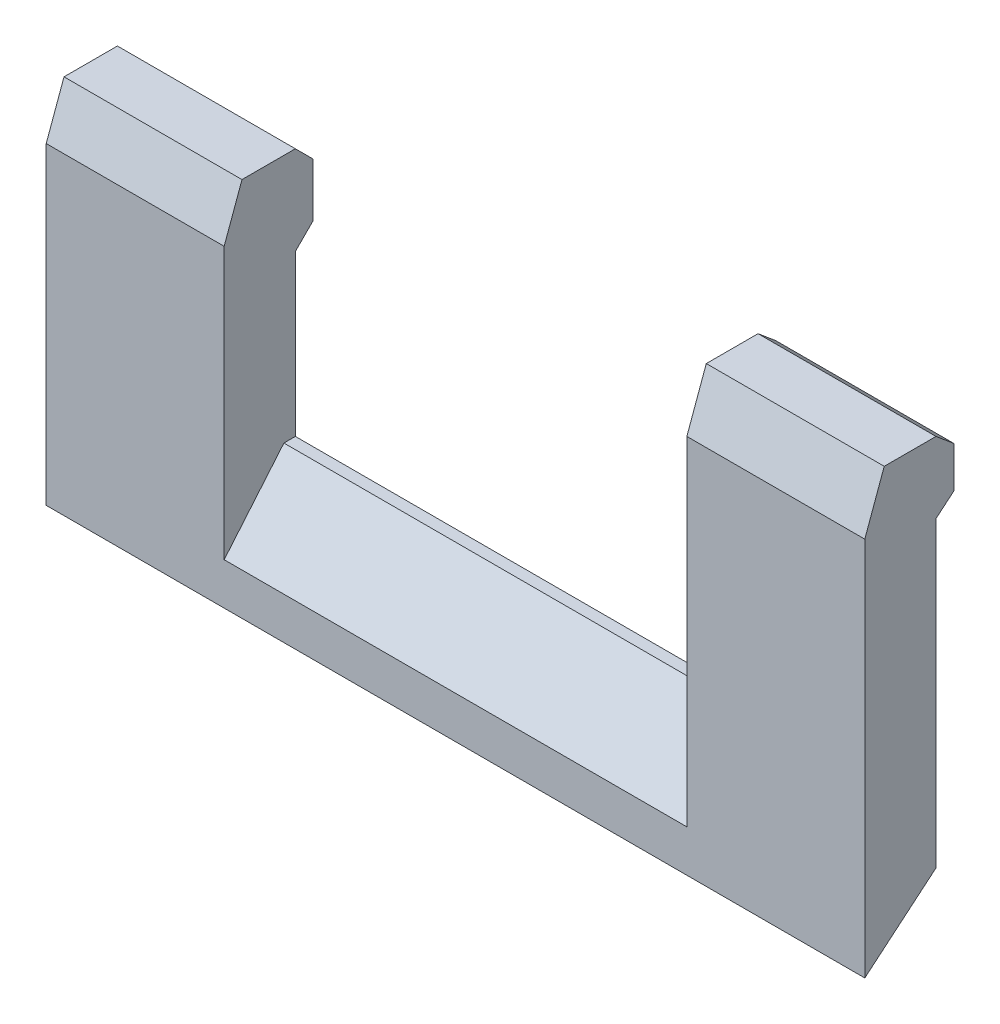
ISO-10303-21;
HEADER;
FILE_DESCRIPTION(('STEP AP214'),'2;1');
FILE_NAME('part.step','',(''),(''),'','','');
FILE_SCHEMA(('AUTOMOTIVE_DESIGN { 1 0 10303 214 1 1 1 1 }'));
ENDSEC;
DATA;
#1=APPLICATION_CONTEXT('core data for automotive mechanical design processes');
#2=APPLICATION_PROTOCOL_DEFINITION('international standard','automotive_design',2000,#1);
#3=PRODUCT_CONTEXT('',#1,'mechanical');
#4=PRODUCT('Part','Part','',(#3));
#5=PRODUCT_RELATED_PRODUCT_CATEGORY('part','',(#4));
#6=PRODUCT_DEFINITION_FORMATION('','',#4);
#7=PRODUCT_DEFINITION_CONTEXT('part definition',#1,'design');
#8=PRODUCT_DEFINITION('design','',#6,#7);
#9=PRODUCT_DEFINITION_SHAPE('','',#8);
#10=(LENGTH_UNIT() NAMED_UNIT(*) SI_UNIT(.MILLI.,.METRE.));
#11=(NAMED_UNIT(*) PLANE_ANGLE_UNIT() SI_UNIT($,.RADIAN.));
#12=(NAMED_UNIT(*) SI_UNIT($,.STERADIAN.) SOLID_ANGLE_UNIT());
#13=UNCERTAINTY_MEASURE_WITH_UNIT(LENGTH_MEASURE(1.E-05),#10,'distance_accuracy_value','');
#14=(GEOMETRIC_REPRESENTATION_CONTEXT(3) GLOBAL_UNCERTAINTY_ASSIGNED_CONTEXT((#13)) GLOBAL_UNIT_ASSIGNED_CONTEXT((#10,
#11,#12)) REPRESENTATION_CONTEXT('',''));
#15=CARTESIAN_POINT('',(0.,0.,0.));
#16=DIRECTION('',(0.,0.,1.));
#17=DIRECTION('',(1.,0.,0.));
#18=AXIS2_PLACEMENT_3D('',#15,#16,#17);
#19=CARTESIAN_POINT('',(11.5,5.,-1.));
#20=DIRECTION('',(0.,0.,1.));
#21=DIRECTION('',(1.,0.,0.));
#22=AXIS2_PLACEMENT_3D('',#19,#20,#21);
#23=PLANE('',#22);
#24=DIRECTION('',(0.,-1.,0.));
#25=VECTOR('',#24,1.);
#26=CARTESIAN_POINT('',(-11.5,5.,-0.999999999999998));
#27=LINE('',#26,#25);
#28=CARTESIAN_POINT('',(-11.5,9.5,-0.999999999999998));
#29=VERTEX_POINT('',#28);
#30=CARTESIAN_POINT('',(-11.5,3.5,-0.999999999999998));
#31=VERTEX_POINT('',#30);
#32=EDGE_CURVE('E258',#29,#31,#27,.T.);
#33=ORIENTED_EDGE('',*,*,#32,.F.);
#34=DIRECTION('',(1.,0.,0.));
#35=VECTOR('',#34,1.);
#36=CARTESIAN_POINT('',(-6.5,9.5,-0.999999999999999));
#37=LINE('',#36,#35);
#38=CARTESIAN_POINT('',(-6.5,9.5,-0.999999999999997));
#39=VERTEX_POINT('',#38);
#40=EDGE_CURVE('E319',#29,#39,#37,.T.);
#41=ORIENTED_EDGE('',*,*,#40,.T.);
#42=DIRECTION('',(0.,-1.,0.));
#43=VECTOR('',#42,1.);
#44=CARTESIAN_POINT('',(-6.5,14.,-0.999999999999997));
#45=LINE('',#44,#43);
#46=CARTESIAN_POINT('',(-6.5,5.,-0.999999999999997));
#47=VERTEX_POINT('',#46);
#48=EDGE_CURVE('E164',#39,#47,#45,.T.);
#49=ORIENTED_EDGE('',*,*,#48,.T.);
#50=DIRECTION('',(-1.,0.,0.));
#51=VECTOR('',#50,1.);
#52=CARTESIAN_POINT('',(11.5,5.,-1.));
#53=LINE('',#52,#51);
#54=CARTESIAN_POINT('',(6.5,5.,-0.999999999999997));
#55=VERTEX_POINT('',#54);
#56=EDGE_CURVE('E254',#55,#47,#53,.T.);
#57=ORIENTED_EDGE('',*,*,#56,.F.);
#58=DIRECTION('',(0.,-1.,0.));
#59=VECTOR('',#58,1.);
#60=CARTESIAN_POINT('',(6.5,14.,-0.999999999999997));
#61=LINE('',#60,#59);
#62=CARTESIAN_POINT('',(6.5,12.,-1.));
#63=VERTEX_POINT('',#62);
#64=EDGE_CURVE('E234',#63,#55,#61,.T.);
#65=ORIENTED_EDGE('',*,*,#64,.F.);
#66=DIRECTION('',(-1.,0.,0.));
#67=VECTOR('',#66,1.);
#68=CARTESIAN_POINT('',(11.5,12.,-1.));
#69=LINE('',#68,#67);
#70=CARTESIAN_POINT('',(11.5,12.,-1.));
#71=VERTEX_POINT('',#70);
#72=EDGE_CURVE('E194',#71,#63,#69,.T.);
#73=ORIENTED_EDGE('',*,*,#72,.F.);
#74=DIRECTION('',(0.,-1.,0.));
#75=VECTOR('',#74,1.);
#76=CARTESIAN_POINT('',(11.5,5.,-1.));
#77=LINE('',#76,#75);
#78=CARTESIAN_POINT('',(11.5,3.5,-0.999999999999997));
#79=VERTEX_POINT('',#78);
#80=EDGE_CURVE('E261',#71,#79,#77,.T.);
#81=ORIENTED_EDGE('',*,*,#80,.T.);
#82=DIRECTION('',(1.,0.,0.));
#83=VECTOR('',#82,1.);
#84=CARTESIAN_POINT('',(-11.5,3.5,-0.999999999999997));
#85=LINE('',#84,#83);
#86=EDGE_CURVE('E213',#31,#79,#85,.T.);
#87=ORIENTED_EDGE('',*,*,#86,.F.);
#88=EDGE_LOOP('',(#33,#41,#49,#57,#65,#73,#81,#87));
#89=FACE_BOUND('',#88,.T.);
#90=ADVANCED_FACE('F39',(#89),#23,.F.);
#91=CARTESIAN_POINT('',(0.,5.,0.));
#92=DIRECTION('',(0.,1.,0.));
#93=DIRECTION('',(0.,0.,1.));
#94=AXIS2_PLACEMENT_3D('',#91,#92,#93);
#95=PLANE('',#94);
#96=DIRECTION('',(1.,0.,0.));
#97=VECTOR('',#96,1.);
#98=CARTESIAN_POINT('',(11.5,5.,-0.678199262354561));
#99=LINE('',#98,#97);
#100=CARTESIAN_POINT('',(-6.5,5.,-0.678199262354559));
#101=VERTEX_POINT('',#100);
#102=CARTESIAN_POINT('',(6.5,5.,-0.67819926235456));
#103=VERTEX_POINT('',#102);
#104=EDGE_CURVE('E270',#101,#103,#99,.T.);
#105=ORIENTED_EDGE('',*,*,#104,.T.);
#106=DIRECTION('',(0.,0.,-1.));
#107=VECTOR('',#106,1.);
#108=CARTESIAN_POINT('',(6.5,5.,0.));
#109=LINE('',#108,#107);
#110=EDGE_CURVE('E241',#103,#55,#109,.T.);
#111=ORIENTED_EDGE('',*,*,#110,.T.);
#112=ORIENTED_EDGE('',*,*,#56,.T.);
#113=DIRECTION('',(0.,0.,1.));
#114=VECTOR('',#113,1.);
#115=CARTESIAN_POINT('',(-6.5,5.,0.));
#116=LINE('',#115,#114);
#117=EDGE_CURVE('E250',#47,#101,#116,.T.);
#118=ORIENTED_EDGE('',*,*,#117,.T.);
#119=EDGE_LOOP('',(#105,#111,#112,#118));
#120=FACE_BOUND('',#119,.T.);
#121=ADVANCED_FACE('F392',(#120),#95,.T.);
#122=CARTESIAN_POINT('',(0.,5.,-0.67819926235456));
#123=DIRECTION('',(0.,0.642787609686538,0.766044443118979));
#124=DIRECTION('',(-1.,0.,0.));
#125=AXIS2_PLACEMENT_3D('',#122,#123,#124);
#126=PLANE('',#125);
#127=DIRECTION('',(-1.,0.,0.));
#128=VECTOR('',#127,1.);
#129=CARTESIAN_POINT('',(-11.5,2.99999999999999,1.));
#130=LINE('',#129,#128);
#131=CARTESIAN_POINT('',(6.5,2.99999999999999,0.999999999999999));
#132=VERTEX_POINT('',#131);
#133=CARTESIAN_POINT('',(-6.5,2.99999999999999,1.));
#134=VERTEX_POINT('',#133);
#135=EDGE_CURVE('E274',#132,#134,#130,.T.);
#136=ORIENTED_EDGE('',*,*,#135,.F.);
#137=DIRECTION('',(0.,0.766044443118979,-0.642787609686538));
#138=VECTOR('',#137,1.);
#139=CARTESIAN_POINT('',(6.5,5.,-0.67819926235456));
#140=LINE('',#139,#138);
#141=EDGE_CURVE('E237',#132,#103,#140,.T.);
#142=ORIENTED_EDGE('',*,*,#141,.T.);
#143=ORIENTED_EDGE('',*,*,#104,.F.);
#144=DIRECTION('',(0.,-0.766044443118979,0.642787609686538));
#145=VECTOR('',#144,1.);
#146=CARTESIAN_POINT('',(-6.5,5.,-0.678199262354559));
#147=LINE('',#146,#145);
#148=EDGE_CURVE('E278',#101,#134,#147,.T.);
#149=ORIENTED_EDGE('',*,*,#148,.T.);
#150=EDGE_LOOP('',(#136,#142,#143,#149));
#151=FACE_BOUND('',#150,.T.);
#152=ADVANCED_FACE('F390',(#151),#126,.T.);
#153=CARTESIAN_POINT('',(-11.5,5.,1.));
#154=DIRECTION('',(1.,0.,0.));
#155=DIRECTION('',(0.,0.,-1.));
#156=AXIS2_PLACEMENT_3D('',#153,#154,#155);
#157=PLANE('',#156);
#158=DIRECTION('',(0.,-1.,0.));
#159=VECTOR('',#158,1.);
#160=CARTESIAN_POINT('',(-11.5,5.,1.));
#161=LINE('',#160,#159);
#162=CARTESIAN_POINT('',(-11.5,10.6262612902727,1.));
#163=VERTEX_POINT('',#162);
#164=CARTESIAN_POINT('',(-11.5,1.82180073764542,0.999999999999999));
#165=VERTEX_POINT('',#164);
#166=EDGE_CURVE('E267',#163,#165,#161,.T.);
#167=ORIENTED_EDGE('',*,*,#166,.F.);
#168=DIRECTION('',(0.,-0.939692620785909,0.342020143325669));
#169=VECTOR('',#168,1.);
#170=CARTESIAN_POINT('',(-11.5,10.6262612902727,1.));
#171=LINE('',#170,#169);
#172=CARTESIAN_POINT('',(-11.5,12.,0.500000000000003));
#173=VERTEX_POINT('',#172);
#174=EDGE_CURVE('E62',#163,#173,#171,.F.);
#175=ORIENTED_EDGE('',*,*,#174,.T.);
#176=DIRECTION('',(0.,0.,-1.));
#177=VECTOR('',#176,1.);
#178=CARTESIAN_POINT('',(-11.5,12.,1.));
#179=LINE('',#178,#177);
#180=CARTESIAN_POINT('',(-11.5,12.,-0.999999999999987));
#181=VERTEX_POINT('',#180);
#182=EDGE_CURVE('E191',#173,#181,#179,.T.);
#183=ORIENTED_EDGE('',*,*,#182,.T.);
#184=DIRECTION('',(0.,-0.707106781186545,-0.70710678118655));
#185=VECTOR('',#184,1.);
#186=CARTESIAN_POINT('',(-11.5,11.5,-1.5));
#187=LINE('',#186,#185);
#188=CARTESIAN_POINT('',(-11.5,11.5,-1.5));
#189=VERTEX_POINT('',#188);
#190=EDGE_CURVE('E331',#181,#189,#187,.T.);
#191=ORIENTED_EDGE('',*,*,#190,.T.);
#192=DIRECTION('',(0.,1.,0.));
#193=VECTOR('',#192,1.);
#194=CARTESIAN_POINT('',(-11.5,12.,-1.5));
#195=LINE('',#194,#193);
#196=CARTESIAN_POINT('',(-11.5,10.,-1.5));
#197=VERTEX_POINT('',#196);
#198=EDGE_CURVE('E185',#197,#189,#195,.T.);
#199=ORIENTED_EDGE('',*,*,#198,.F.);
#200=DIRECTION('',(0.,0.707106781186543,-0.707106781186552));
#201=VECTOR('',#200,1.);
#202=CARTESIAN_POINT('',(-11.5,6.25000000000003,2.25000000000001));
#203=LINE('',#202,#201);
#204=EDGE_CURVE('E170',#197,#29,#203,.F.);
#205=ORIENTED_EDGE('',*,*,#204,.T.);
#206=ORIENTED_EDGE('',*,*,#32,.T.);
#207=DIRECTION('',(0.,-0.642787609686544,0.766044443118974));
#208=VECTOR('',#207,1.);
#209=CARTESIAN_POINT('',(-11.5,1.82180073764542,0.999999999999999));
#210=LINE('',#209,#208);
#211=EDGE_CURVE('E209',#31,#165,#210,.T.);
#212=ORIENTED_EDGE('',*,*,#211,.T.);
#213=EDGE_LOOP('',(#167,#175,#183,#191,#199,#205,#206,#212));
#214=FACE_BOUND('',#213,.T.);
#215=ADVANCED_FACE('F348',(#214),#157,.F.);
#216=CARTESIAN_POINT('',(11.5,5.,0.999999999999999));
#217=DIRECTION('',(0.,0.,-1.));
#218=DIRECTION('',(-1.,0.,0.));
#219=AXIS2_PLACEMENT_3D('',#216,#217,#218);
#220=PLANE('',#219);
#221=DIRECTION('',(0.,-1.,0.));
#222=VECTOR('',#221,1.);
#223=CARTESIAN_POINT('',(-6.5,14.,0.999999999999999));
#224=LINE('',#223,#222);
#225=CARTESIAN_POINT('',(-6.5,10.6262612902727,0.999999999999999));
#226=VERTEX_POINT('',#225);
#227=EDGE_CURVE('E247',#226,#134,#224,.T.);
#228=ORIENTED_EDGE('',*,*,#227,.F.);
#229=DIRECTION('',(-1.,0.,0.));
#230=VECTOR('',#229,1.);
#231=CARTESIAN_POINT('',(11.5,10.6262612902727,0.999999999999999));
#232=LINE('',#231,#230);
#233=EDGE_CURVE('E169',#226,#163,#232,.T.);
#234=ORIENTED_EDGE('',*,*,#233,.T.);
#235=ORIENTED_EDGE('',*,*,#166,.T.);
#236=DIRECTION('',(1.,0.,0.));
#237=VECTOR('',#236,1.);
#238=CARTESIAN_POINT('',(-11.5,1.82180073764542,0.999999999999999));
#239=LINE('',#238,#237);
#240=CARTESIAN_POINT('',(11.5,1.82180073764542,0.999999999999999));
#241=VERTEX_POINT('',#240);
#242=EDGE_CURVE('E217',#165,#241,#239,.T.);
#243=ORIENTED_EDGE('',*,*,#242,.T.);
#244=DIRECTION('',(0.,-1.,0.));
#245=VECTOR('',#244,1.);
#246=CARTESIAN_POINT('',(11.5,5.,0.999999999999999));
#247=LINE('',#246,#245);
#248=CARTESIAN_POINT('',(11.5,12.5,0.999999999999999));
#249=VERTEX_POINT('',#248);
#250=EDGE_CURVE('E264',#249,#241,#247,.T.);
#251=ORIENTED_EDGE('',*,*,#250,.F.);
#252=DIRECTION('',(-1.,0.,0.));
#253=VECTOR('',#252,1.);
#254=CARTESIAN_POINT('',(6.5,12.5,0.999999999999999));
#255=LINE('',#254,#253);
#256=CARTESIAN_POINT('',(6.5,12.5,0.999999999999999));
#257=VERTEX_POINT('',#256);
#258=EDGE_CURVE('E313',#249,#257,#255,.T.);
#259=ORIENTED_EDGE('',*,*,#258,.T.);
#260=DIRECTION('',(0.,-1.,0.));
#261=VECTOR('',#260,1.);
#262=CARTESIAN_POINT('',(6.5,14.,0.999999999999999));
#263=LINE('',#262,#261);
#264=EDGE_CURVE('E231',#257,#132,#263,.T.);
#265=ORIENTED_EDGE('',*,*,#264,.T.);
#266=ORIENTED_EDGE('',*,*,#135,.T.);
#267=EDGE_LOOP('',(#228,#234,#235,#243,#251,#259,#265,#266));
#268=FACE_BOUND('',#267,.T.);
#269=ADVANCED_FACE('F344',(#268),#220,.F.);
#270=CARTESIAN_POINT('',(11.5,5.,0.999999999999999));
#271=DIRECTION('',(-1.,0.,0.));
#272=DIRECTION('',(0.,0.,1.));
#273=AXIS2_PLACEMENT_3D('',#270,#271,#272);
#274=PLANE('',#273);
#275=DIRECTION('',(0.,0.,-1.));
#276=VECTOR('',#275,1.);
#277=CARTESIAN_POINT('',(11.5,14.,-0.999999999999997));
#278=LINE('',#277,#276);
#279=CARTESIAN_POINT('',(11.5,14.,0.454044648600696));
#280=VERTEX_POINT('',#279);
#281=CARTESIAN_POINT('',(11.5,14.,-0.999999999999997));
#282=VERTEX_POINT('',#281);
#283=EDGE_CURVE('E228',#280,#282,#278,.T.);
#284=ORIENTED_EDGE('',*,*,#283,.F.);
#285=DIRECTION('',(0.,-0.939692620785909,0.342020143325666));
#286=VECTOR('',#285,1.);
#287=CARTESIAN_POINT('',(11.5,14.,0.454044648600696));
#288=LINE('',#287,#286);
#289=EDGE_CURVE('E310',#280,#249,#288,.T.);
#290=ORIENTED_EDGE('',*,*,#289,.T.);
#291=ORIENTED_EDGE('',*,*,#250,.T.);
#292=DIRECTION('',(0.,-0.642787609686544,0.766044443118974));
#293=VECTOR('',#292,1.);
#294=CARTESIAN_POINT('',(11.5,1.82180073764542,0.999999999999999));
#295=LINE('',#294,#293);
#296=EDGE_CURVE('E205',#79,#241,#295,.T.);
#297=ORIENTED_EDGE('',*,*,#296,.F.);
#298=ORIENTED_EDGE('',*,*,#80,.F.);
#299=DIRECTION('',(0.,0.642787609686536,-0.766044443118981));
#300=VECTOR('',#299,1.);
#301=CARTESIAN_POINT('',(11.5,12.4195498155886,-1.5));
#302=LINE('',#301,#300);
#303=CARTESIAN_POINT('',(11.5,12.4195498155886,-1.5));
#304=VERTEX_POINT('',#303);
#305=EDGE_CURVE('E300',#71,#304,#302,.T.);
#306=ORIENTED_EDGE('',*,*,#305,.T.);
#307=DIRECTION('',(0.,-1.,0.));
#308=VECTOR('',#307,1.);
#309=CARTESIAN_POINT('',(11.5,14.,-1.5));
#310=LINE('',#309,#308);
#311=CARTESIAN_POINT('',(11.5,13.5804501844114,-1.5));
#312=VERTEX_POINT('',#311);
#313=EDGE_CURVE('E197',#312,#304,#310,.T.);
#314=ORIENTED_EDGE('',*,*,#313,.F.);
#315=DIRECTION('',(0.,-0.642787609686536,-0.766044443118981));
#316=VECTOR('',#315,1.);
#317=CARTESIAN_POINT('',(11.5,13.5804501844114,-1.5));
#318=LINE('',#317,#316);
#319=EDGE_CURVE('E296',#312,#282,#318,.F.);
#320=ORIENTED_EDGE('',*,*,#319,.T.);
#321=EDGE_LOOP('',(#284,#290,#291,#297,#298,#306,#314,#320));
#322=FACE_BOUND('',#321,.T.);
#323=ADVANCED_FACE('F361',(#322),#274,.F.);
#324=CARTESIAN_POINT('',(-6.5,14.,-0.999999999999997));
#325=DIRECTION('',(-1.,0.,0.));
#326=DIRECTION('',(0.,0.,1.));
#327=AXIS2_PLACEMENT_3D('',#324,#325,#326);
#328=PLANE('',#327);
#329=DIRECTION('',(0.,0.,-1.));
#330=VECTOR('',#329,1.);
#331=CARTESIAN_POINT('',(-6.5,12.,1.));
#332=LINE('',#331,#330);
#333=CARTESIAN_POINT('',(-6.5,12.,0.500000000000002));
#334=VERTEX_POINT('',#333);
#335=CARTESIAN_POINT('',(-6.5,12.,-0.999999999999988));
#336=VERTEX_POINT('',#335);
#337=EDGE_CURVE('E188',#334,#336,#332,.T.);
#338=ORIENTED_EDGE('',*,*,#337,.F.);
#339=DIRECTION('',(0.,0.939692620785909,-0.342020143325669));
#340=VECTOR('',#339,1.);
#341=CARTESIAN_POINT('',(-6.5,10.6262612902727,1.));
#342=LINE('',#341,#340);
#343=EDGE_CURVE('E11',#334,#226,#342,.F.);
#344=ORIENTED_EDGE('',*,*,#343,.T.);
#345=ORIENTED_EDGE('',*,*,#227,.T.);
#346=ORIENTED_EDGE('',*,*,#148,.F.);
#347=ORIENTED_EDGE('',*,*,#117,.F.);
#348=ORIENTED_EDGE('',*,*,#48,.F.);
#349=DIRECTION('',(0.,-0.707106781186543,0.707106781186552));
#350=VECTOR('',#349,1.);
#351=CARTESIAN_POINT('',(-6.5,11.75,-3.25));
#352=LINE('',#351,#350);
#353=CARTESIAN_POINT('',(-6.5,10.,-1.5));
#354=VERTEX_POINT('',#353);
#355=EDGE_CURVE('E158',#39,#354,#352,.F.);
#356=ORIENTED_EDGE('',*,*,#355,.T.);
#357=DIRECTION('',(0.,-1.,0.));
#358=VECTOR('',#357,1.);
#359=CARTESIAN_POINT('',(-6.5,12.,-1.5));
#360=LINE('',#359,#358);
#361=CARTESIAN_POINT('',(-6.5,11.5,-1.5));
#362=VERTEX_POINT('',#361);
#363=EDGE_CURVE('E162',#362,#354,#360,.T.);
#364=ORIENTED_EDGE('',*,*,#363,.F.);
#365=DIRECTION('',(0.,0.707106781186545,0.70710678118655));
#366=VECTOR('',#365,1.);
#367=CARTESIAN_POINT('',(-6.5,11.5,-1.5));
#368=LINE('',#367,#366);
#369=EDGE_CURVE('E324',#362,#336,#368,.T.);
#370=ORIENTED_EDGE('',*,*,#369,.T.);
#371=EDGE_LOOP('',(#338,#344,#345,#346,#347,#348,#356,#364,#370));
#372=FACE_BOUND('',#371,.T.);
#373=ADVANCED_FACE('F160',(#372),#328,.F.);
#374=CARTESIAN_POINT('',(6.5,14.,-0.999999999999997));
#375=DIRECTION('',(1.,0.,0.));
#376=DIRECTION('',(0.,0.,-1.));
#377=AXIS2_PLACEMENT_3D('',#374,#375,#376);
#378=PLANE('',#377);
#379=ORIENTED_EDGE('',*,*,#264,.F.);
#380=DIRECTION('',(0.,0.939692620785909,-0.342020143325666));
#381=VECTOR('',#380,1.);
#382=CARTESIAN_POINT('',(6.5,14.,0.454044648600697));
#383=LINE('',#382,#381);
#384=CARTESIAN_POINT('',(6.5,14.,0.454044648600697));
#385=VERTEX_POINT('',#384);
#386=EDGE_CURVE('E316',#257,#385,#383,.T.);
#387=ORIENTED_EDGE('',*,*,#386,.T.);
#388=DIRECTION('',(0.,0.,1.));
#389=VECTOR('',#388,1.);
#390=CARTESIAN_POINT('',(6.5,14.,-0.999999999999997));
#391=LINE('',#390,#389);
#392=CARTESIAN_POINT('',(6.5,14.,-0.999999999999997));
#393=VERTEX_POINT('',#392);
#394=EDGE_CURVE('E221',#393,#385,#391,.T.);
#395=ORIENTED_EDGE('',*,*,#394,.F.);
#396=DIRECTION('',(0.,0.642787609686536,0.766044443118981));
#397=VECTOR('',#396,1.);
#398=CARTESIAN_POINT('',(6.5,13.5804501844114,-1.5));
#399=LINE('',#398,#397);
#400=CARTESIAN_POINT('',(6.5,13.5804501844114,-1.5));
#401=VERTEX_POINT('',#400);
#402=EDGE_CURVE('E290',#393,#401,#399,.F.);
#403=ORIENTED_EDGE('',*,*,#402,.T.);
#404=DIRECTION('',(0.,1.,0.));
#405=VECTOR('',#404,1.);
#406=CARTESIAN_POINT('',(6.5,14.,-1.5));
#407=LINE('',#406,#405);
#408=CARTESIAN_POINT('',(6.5,12.4195498155886,-1.5));
#409=VERTEX_POINT('',#408);
#410=EDGE_CURVE('E201',#409,#401,#407,.T.);
#411=ORIENTED_EDGE('',*,*,#410,.F.);
#412=DIRECTION('',(0.,-0.642787609686536,0.766044443118981));
#413=VECTOR('',#412,1.);
#414=CARTESIAN_POINT('',(6.5,12.4195498155886,-1.5));
#415=LINE('',#414,#413);
#416=EDGE_CURVE('E293',#409,#63,#415,.T.);
#417=ORIENTED_EDGE('',*,*,#416,.T.);
#418=ORIENTED_EDGE('',*,*,#64,.T.);
#419=ORIENTED_EDGE('',*,*,#110,.F.);
#420=ORIENTED_EDGE('',*,*,#141,.F.);
#421=EDGE_LOOP('',(#379,#387,#395,#403,#411,#417,#418,#419,#420));
#422=FACE_BOUND('',#421,.T.);
#423=ADVANCED_FACE('F372',(#422),#378,.F.);
#424=CARTESIAN_POINT('',(0.,14.,0.));
#425=DIRECTION('',(0.,1.,0.));
#426=DIRECTION('',(0.,0.,1.));
#427=AXIS2_PLACEMENT_3D('',#424,#425,#426);
#428=PLANE('',#427);
#429=ORIENTED_EDGE('',*,*,#394,.T.);
#430=DIRECTION('',(1.,0.,0.));
#431=VECTOR('',#430,1.);
#432=CARTESIAN_POINT('',(11.5,14.,0.454044648600696));
#433=LINE('',#432,#431);
#434=EDGE_CURVE('E306',#385,#280,#433,.T.);
#435=ORIENTED_EDGE('',*,*,#434,.T.);
#436=ORIENTED_EDGE('',*,*,#283,.T.);
#437=DIRECTION('',(-1.,0.,0.));
#438=VECTOR('',#437,1.);
#439=CARTESIAN_POINT('',(0.,14.,-0.999999999999996));
#440=LINE('',#439,#438);
#441=EDGE_CURVE('E303',#282,#393,#440,.T.);
#442=ORIENTED_EDGE('',*,*,#441,.T.);
#443=EDGE_LOOP('',(#429,#435,#436,#442));
#444=FACE_BOUND('',#443,.T.);
#445=ADVANCED_FACE('F380',(#444),#428,.T.);
#446=CARTESIAN_POINT('',(-11.5,1.82180073764542,0.999999999999999));
#447=DIRECTION('',(0.,0.766044443118974,0.642787609686544));
#448=DIRECTION('',(0.,-0.642787609686544,0.766044443118975));
#449=AXIS2_PLACEMENT_3D('',#446,#447,#448);
#450=PLANE('',#449);
#451=ORIENTED_EDGE('',*,*,#296,.T.);
#452=ORIENTED_EDGE('',*,*,#242,.F.);
#453=ORIENTED_EDGE('',*,*,#211,.F.);
#454=ORIENTED_EDGE('',*,*,#86,.T.);
#455=EDGE_LOOP('',(#451,#452,#453,#454));
#456=FACE_BOUND('',#455,.T.);
#457=ADVANCED_FACE('F353',(#456),#450,.F.);
#458=CARTESIAN_POINT('',(0.,0.,-1.5));
#459=DIRECTION('',(0.,0.,-1.));
#460=DIRECTION('',(-1.,0.,0.));
#461=AXIS2_PLACEMENT_3D('',#458,#459,#460);
#462=PLANE('',#461);
#463=ORIENTED_EDGE('',*,*,#313,.T.);
#464=DIRECTION('',(-1.,0.,0.));
#465=VECTOR('',#464,1.);
#466=CARTESIAN_POINT('',(6.5,12.4195498155886,-1.5));
#467=LINE('',#466,#465);
#468=EDGE_CURVE('E286',#304,#409,#467,.T.);
#469=ORIENTED_EDGE('',*,*,#468,.T.);
#470=ORIENTED_EDGE('',*,*,#410,.T.);
#471=DIRECTION('',(1.,0.,0.));
#472=VECTOR('',#471,1.);
#473=CARTESIAN_POINT('',(0.,13.5804501844114,-1.5));
#474=LINE('',#473,#472);
#475=EDGE_CURVE('E282',#401,#312,#474,.T.);
#476=ORIENTED_EDGE('',*,*,#475,.T.);
#477=EDGE_LOOP('',(#463,#469,#470,#476));
#478=FACE_BOUND('',#477,.T.);
#479=ADVANCED_FACE('F368',(#478),#462,.T.);
#480=CARTESIAN_POINT('',(0.,12.4195498155886,-1.5));
#481=DIRECTION('',(0.,-0.766044443118981,-0.642787609686536));
#482=DIRECTION('',(1.,0.,0.));
#483=AXIS2_PLACEMENT_3D('',#480,#481,#482);
#484=PLANE('',#483);
#485=ORIENTED_EDGE('',*,*,#305,.F.);
#486=ORIENTED_EDGE('',*,*,#72,.T.);
#487=ORIENTED_EDGE('',*,*,#416,.F.);
#488=ORIENTED_EDGE('',*,*,#468,.F.);
#489=EDGE_LOOP('',(#485,#486,#487,#488));
#490=FACE_BOUND('',#489,.T.);
#491=ADVANCED_FACE('F365',(#490),#484,.T.);
#492=CARTESIAN_POINT('',(0.,13.5804501844114,-1.5));
#493=DIRECTION('',(0.,-0.766044443118981,0.642787609686536));
#494=DIRECTION('',(1.,0.,0.));
#495=AXIS2_PLACEMENT_3D('',#492,#493,#494);
#496=PLANE('',#495);
#497=ORIENTED_EDGE('',*,*,#402,.F.);
#498=ORIENTED_EDGE('',*,*,#441,.F.);
#499=ORIENTED_EDGE('',*,*,#319,.F.);
#500=ORIENTED_EDGE('',*,*,#475,.F.);
#501=EDGE_LOOP('',(#497,#498,#499,#500));
#502=FACE_BOUND('',#501,.T.);
#503=ADVANCED_FACE('F377',(#502),#496,.F.);
#504=CARTESIAN_POINT('',(-6.5,12.,1.));
#505=DIRECTION('',(0.,-1.,0.));
#506=DIRECTION('',(0.,0.,-1.));
#507=AXIS2_PLACEMENT_3D('',#504,#505,#506);
#508=PLANE('',#507);
#509=ORIENTED_EDGE('',*,*,#182,.F.);
#510=DIRECTION('',(1.,0.,0.));
#511=VECTOR('',#510,1.);
#512=CARTESIAN_POINT('',(-6.5,12.,0.500000000000002));
#513=LINE('',#512,#511);
#514=EDGE_CURVE('E48',#173,#334,#513,.T.);
#515=ORIENTED_EDGE('',*,*,#514,.T.);
#516=ORIENTED_EDGE('',*,*,#337,.T.);
#517=DIRECTION('',(-1.,0.,0.));
#518=VECTOR('',#517,1.);
#519=CARTESIAN_POINT('',(-11.5,12.,-0.999999999999987));
#520=LINE('',#519,#518);
#521=EDGE_CURVE('E327',#336,#181,#520,.T.);
#522=ORIENTED_EDGE('',*,*,#521,.T.);
#523=EDGE_LOOP('',(#509,#515,#516,#522));
#524=FACE_BOUND('',#523,.T.);
#525=ADVANCED_FACE('F415',(#524),#508,.F.);
#526=CARTESIAN_POINT('',(0.,14.,0.454044648600697));
#527=DIRECTION('',(0.,0.342020143325666,0.939692620785909));
#528=DIRECTION('',(-1.,0.,0.));
#529=AXIS2_PLACEMENT_3D('',#526,#527,#528);
#530=PLANE('',#529);
#531=ORIENTED_EDGE('',*,*,#386,.F.);
#532=ORIENTED_EDGE('',*,*,#258,.F.);
#533=ORIENTED_EDGE('',*,*,#289,.F.);
#534=ORIENTED_EDGE('',*,*,#434,.F.);
#535=EDGE_LOOP('',(#531,#532,#533,#534));
#536=FACE_BOUND('',#535,.T.);
#537=ADVANCED_FACE('F384',(#536),#530,.T.);
#538=CARTESIAN_POINT('',(0.,0.,-1.5));
#539=DIRECTION('',(0.,0.,-1.));
#540=DIRECTION('',(-1.,0.,0.));
#541=AXIS2_PLACEMENT_3D('',#538,#539,#540);
#542=PLANE('',#541);
#543=ORIENTED_EDGE('',*,*,#198,.T.);
#544=DIRECTION('',(1.,0.,0.));
#545=VECTOR('',#544,1.);
#546=CARTESIAN_POINT('',(-6.5,11.5,-1.5));
#547=LINE('',#546,#545);
#548=EDGE_CURVE('E180',#189,#362,#547,.T.);
#549=ORIENTED_EDGE('',*,*,#548,.T.);
#550=ORIENTED_EDGE('',*,*,#363,.T.);
#551=DIRECTION('',(-1.,0.,0.));
#552=VECTOR('',#551,1.);
#553=CARTESIAN_POINT('',(-6.5,10.,-1.5));
#554=LINE('',#553,#552);
#555=EDGE_CURVE('E177',#354,#197,#554,.T.);
#556=ORIENTED_EDGE('',*,*,#555,.T.);
#557=EDGE_LOOP('',(#543,#549,#550,#556));
#558=FACE_BOUND('',#557,.T.);
#559=ADVANCED_FACE('F176',(#558),#542,.T.);
#560=CARTESIAN_POINT('',(-6.5,10.,-1.50000000000001));
#561=DIRECTION('',(0.,-0.707106781186552,-0.707106781186543));
#562=DIRECTION('',(1.,0.,0.));
#563=AXIS2_PLACEMENT_3D('',#560,#561,#562);
#564=PLANE('',#563);
#565=ORIENTED_EDGE('',*,*,#355,.F.);
#566=ORIENTED_EDGE('',*,*,#40,.F.);
#567=ORIENTED_EDGE('',*,*,#204,.F.);
#568=ORIENTED_EDGE('',*,*,#555,.F.);
#569=EDGE_LOOP('',(#565,#566,#567,#568));
#570=FACE_BOUND('',#569,.T.);
#571=ADVANCED_FACE('F183',(#570),#564,.T.);
#572=CARTESIAN_POINT('',(0.,11.5,-1.5));
#573=DIRECTION('',(0.,0.70710678118655,-0.707106781186545));
#574=DIRECTION('',(-1.,0.,0.));
#575=AXIS2_PLACEMENT_3D('',#572,#573,#574);
#576=PLANE('',#575);
#577=ORIENTED_EDGE('',*,*,#190,.F.);
#578=ORIENTED_EDGE('',*,*,#521,.F.);
#579=ORIENTED_EDGE('',*,*,#369,.F.);
#580=ORIENTED_EDGE('',*,*,#548,.F.);
#581=EDGE_LOOP('',(#577,#578,#579,#580));
#582=FACE_BOUND('',#581,.T.);
#583=ADVANCED_FACE('F419',(#582),#576,.T.);
#584=CARTESIAN_POINT('',(11.5,10.6262612902727,0.999999999999999));
#585=DIRECTION('',(0.,-0.342020143325669,-0.939692620785908));
#586=DIRECTION('',(-1.,0.,0.));
#587=AXIS2_PLACEMENT_3D('',#584,#585,#586);
#588=PLANE('',#587);
#589=ORIENTED_EDGE('',*,*,#343,.F.);
#590=ORIENTED_EDGE('',*,*,#514,.F.);
#591=ORIENTED_EDGE('',*,*,#174,.F.);
#592=ORIENTED_EDGE('',*,*,#233,.F.);
#593=EDGE_LOOP('',(#589,#590,#591,#592));
#594=FACE_BOUND('',#593,.T.);
#595=ADVANCED_FACE('F41',(#594),#588,.F.);
#596=CLOSED_SHELL('',(#90,#121,#152,#215,#269,#323,#373,#423,#445,#457,#479,#491,#503,#525,#537,
#559,#571,#583,#595));
#597=MANIFOLD_SOLID_BREP('B2',#596);
#598=ADVANCED_BREP_SHAPE_REPRESENTATION('',(#18,#597),#14);
#599=SHAPE_DEFINITION_REPRESENTATION(#9,#598);
ENDSEC;
END-ISO-10303-21;
